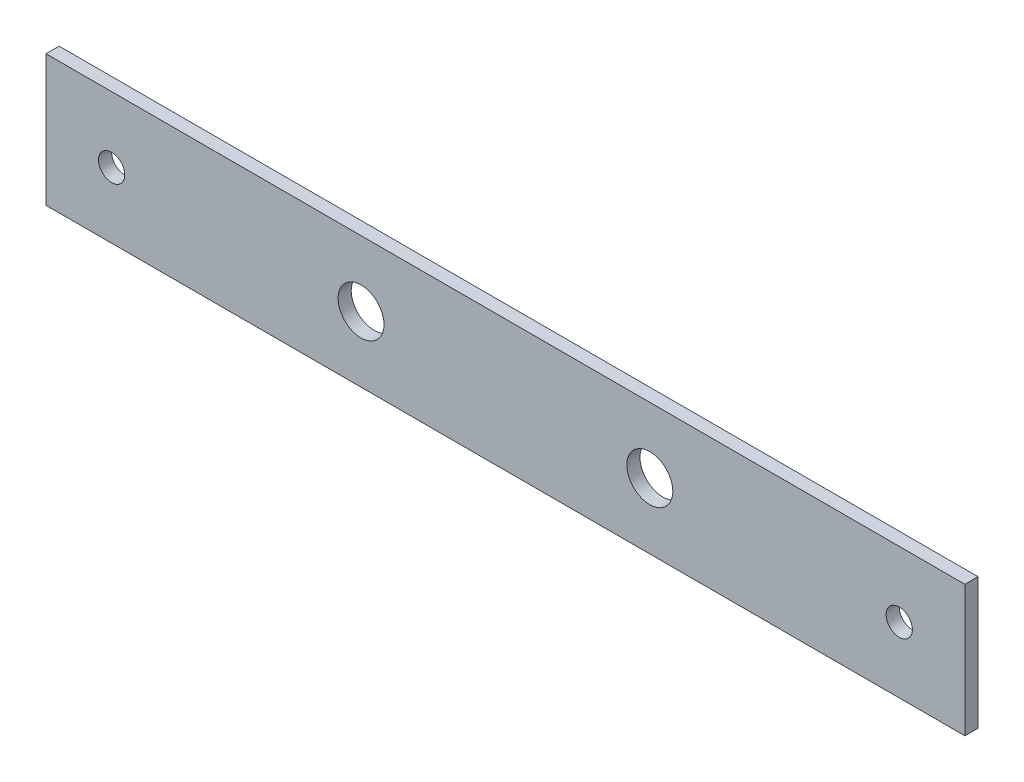
ISO-10303-21;
HEADER;
FILE_DESCRIPTION(('STEP AP214'),'2;1');
FILE_NAME('part.step','',(''),(''),'','','');
FILE_SCHEMA(('AUTOMOTIVE_DESIGN { 1 0 10303 214 1 1 1 1 }'));
ENDSEC;
DATA;
#1=APPLICATION_CONTEXT('core data for automotive mechanical design processes');
#2=APPLICATION_PROTOCOL_DEFINITION('international standard','automotive_design',2000,#1);
#3=PRODUCT_CONTEXT('',#1,'mechanical');
#4=PRODUCT('Part','Part','',(#3));
#5=PRODUCT_RELATED_PRODUCT_CATEGORY('part','',(#4));
#6=PRODUCT_DEFINITION_FORMATION('','',#4);
#7=PRODUCT_DEFINITION_CONTEXT('part definition',#1,'design');
#8=PRODUCT_DEFINITION('design','',#6,#7);
#9=PRODUCT_DEFINITION_SHAPE('','',#8);
#10=(LENGTH_UNIT() NAMED_UNIT(*) SI_UNIT(.MILLI.,.METRE.));
#11=(NAMED_UNIT(*) PLANE_ANGLE_UNIT() SI_UNIT($,.RADIAN.));
#12=(NAMED_UNIT(*) SI_UNIT($,.STERADIAN.) SOLID_ANGLE_UNIT());
#13=UNCERTAINTY_MEASURE_WITH_UNIT(LENGTH_MEASURE(1.E-05),#10,'distance_accuracy_value','');
#14=(GEOMETRIC_REPRESENTATION_CONTEXT(3) GLOBAL_UNCERTAINTY_ASSIGNED_CONTEXT((#13)) GLOBAL_UNIT_ASSIGNED_CONTEXT((#10,
#11,#12)) REPRESENTATION_CONTEXT('',''));
#15=CARTESIAN_POINT('',(0.,0.,0.));
#16=DIRECTION('',(0.,0.,1.));
#17=DIRECTION('',(1.,0.,0.));
#18=AXIS2_PLACEMENT_3D('',#15,#16,#17);
#19=CARTESIAN_POINT('',(70.,-10.,2.));
#20=DIRECTION('',(-1.,0.,0.));
#21=DIRECTION('',(0.,0.,1.));
#22=AXIS2_PLACEMENT_3D('',#19,#20,#21);
#23=PLANE('',#22);
#24=DIRECTION('',(0.,1.,0.));
#25=VECTOR('',#24,1.);
#26=CARTESIAN_POINT('',(70.,-10.,0.));
#27=LINE('',#26,#25);
#28=CARTESIAN_POINT('',(70.,-10.,0.));
#29=VERTEX_POINT('',#28);
#30=CARTESIAN_POINT('',(70.,10.,0.));
#31=VERTEX_POINT('',#30);
#32=EDGE_CURVE('E97',#29,#31,#27,.T.);
#33=ORIENTED_EDGE('',*,*,#32,.T.);
#34=DIRECTION('',(0.,0.,-1.));
#35=VECTOR('',#34,1.);
#36=CARTESIAN_POINT('',(70.,10.,2.));
#37=LINE('',#36,#35);
#38=CARTESIAN_POINT('',(70.,10.,2.));
#39=VERTEX_POINT('',#38);
#40=EDGE_CURVE('E11',#39,#31,#37,.T.);
#41=ORIENTED_EDGE('',*,*,#40,.F.);
#42=DIRECTION('',(0.,1.,0.));
#43=VECTOR('',#42,1.);
#44=CARTESIAN_POINT('',(70.,-10.,2.));
#45=LINE('',#44,#43);
#46=CARTESIAN_POINT('',(70.,-10.,2.));
#47=VERTEX_POINT('',#46);
#48=EDGE_CURVE('E85',#47,#39,#45,.T.);
#49=ORIENTED_EDGE('',*,*,#48,.F.);
#50=DIRECTION('',(0.,0.,-1.));
#51=VECTOR('',#50,1.);
#52=CARTESIAN_POINT('',(70.,-10.,2.));
#53=LINE('',#52,#51);
#54=EDGE_CURVE('E93',#47,#29,#53,.T.);
#55=ORIENTED_EDGE('',*,*,#54,.T.);
#56=EDGE_LOOP('',(#33,#41,#49,#55));
#57=FACE_BOUND('',#56,.T.);
#58=ADVANCED_FACE('F34',(#57),#23,.F.);
#59=CARTESIAN_POINT('',(-70.,10.,2.));
#60=DIRECTION('',(0.,-1.,0.));
#61=DIRECTION('',(0.,0.,-1.));
#62=AXIS2_PLACEMENT_3D('',#59,#60,#61);
#63=PLANE('',#62);
#64=DIRECTION('',(-1.,0.,0.));
#65=VECTOR('',#64,1.);
#66=CARTESIAN_POINT('',(-70.,10.,0.));
#67=LINE('',#66,#65);
#68=CARTESIAN_POINT('',(-70.,10.,0.));
#69=VERTEX_POINT('',#68);
#70=EDGE_CURVE('E89',#31,#69,#67,.T.);
#71=ORIENTED_EDGE('',*,*,#70,.T.);
#72=DIRECTION('',(0.,0.,-1.));
#73=VECTOR('',#72,1.);
#74=CARTESIAN_POINT('',(-70.,10.,2.));
#75=LINE('',#74,#73);
#76=CARTESIAN_POINT('',(-70.,10.,2.));
#77=VERTEX_POINT('',#76);
#78=EDGE_CURVE('E42',#77,#69,#75,.T.);
#79=ORIENTED_EDGE('',*,*,#78,.F.);
#80=DIRECTION('',(-1.,0.,0.));
#81=VECTOR('',#80,1.);
#82=CARTESIAN_POINT('',(-70.,10.,2.));
#83=LINE('',#82,#81);
#84=EDGE_CURVE('E80',#39,#77,#83,.T.);
#85=ORIENTED_EDGE('',*,*,#84,.F.);
#86=ORIENTED_EDGE('',*,*,#40,.T.);
#87=EDGE_LOOP('',(#71,#79,#85,#86));
#88=FACE_BOUND('',#87,.T.);
#89=ADVANCED_FACE('F88',(#88),#63,.F.);
#90=CARTESIAN_POINT('',(-70.,-10.,2.));
#91=DIRECTION('',(1.,0.,0.));
#92=DIRECTION('',(0.,0.,-1.));
#93=AXIS2_PLACEMENT_3D('',#90,#91,#92);
#94=PLANE('',#93);
#95=DIRECTION('',(0.,-1.,0.));
#96=VECTOR('',#95,1.);
#97=CARTESIAN_POINT('',(-70.,-10.,0.));
#98=LINE('',#97,#96);
#99=CARTESIAN_POINT('',(-70.,-10.,0.));
#100=VERTEX_POINT('',#99);
#101=EDGE_CURVE('E67',#69,#100,#98,.T.);
#102=ORIENTED_EDGE('',*,*,#101,.T.);
#103=DIRECTION('',(0.,0.,-1.));
#104=VECTOR('',#103,1.);
#105=CARTESIAN_POINT('',(-70.,-10.,2.));
#106=LINE('',#105,#104);
#107=CARTESIAN_POINT('',(-70.,-10.,2.));
#108=VERTEX_POINT('',#107);
#109=EDGE_CURVE('E90',#108,#100,#106,.T.);
#110=ORIENTED_EDGE('',*,*,#109,.F.);
#111=DIRECTION('',(0.,-1.,0.));
#112=VECTOR('',#111,1.);
#113=CARTESIAN_POINT('',(-70.,-10.,2.));
#114=LINE('',#113,#112);
#115=EDGE_CURVE('E83',#77,#108,#114,.T.);
#116=ORIENTED_EDGE('',*,*,#115,.F.);
#117=ORIENTED_EDGE('',*,*,#78,.T.);
#118=EDGE_LOOP('',(#102,#110,#116,#117));
#119=FACE_BOUND('',#118,.T.);
#120=ADVANCED_FACE('F91',(#119),#94,.F.);
#121=CARTESIAN_POINT('',(-70.,-10.,2.));
#122=DIRECTION('',(0.,1.,0.));
#123=DIRECTION('',(0.,0.,1.));
#124=AXIS2_PLACEMENT_3D('',#121,#122,#123);
#125=PLANE('',#124);
#126=DIRECTION('',(1.,0.,0.));
#127=VECTOR('',#126,1.);
#128=CARTESIAN_POINT('',(-70.,-10.,0.));
#129=LINE('',#128,#127);
#130=EDGE_CURVE('E73',#100,#29,#129,.T.);
#131=ORIENTED_EDGE('',*,*,#130,.T.);
#132=ORIENTED_EDGE('',*,*,#54,.F.);
#133=DIRECTION('',(1.,0.,0.));
#134=VECTOR('',#133,1.);
#135=CARTESIAN_POINT('',(-70.,-10.,2.));
#136=LINE('',#135,#134);
#137=EDGE_CURVE('E50',#108,#47,#136,.T.);
#138=ORIENTED_EDGE('',*,*,#137,.F.);
#139=ORIENTED_EDGE('',*,*,#109,.T.);
#140=EDGE_LOOP('',(#131,#132,#138,#139));
#141=FACE_BOUND('',#140,.T.);
#142=ADVANCED_FACE('F105',(#141),#125,.F.);
#143=CARTESIAN_POINT('',(0.,0.,2.));
#144=DIRECTION('',(0.,0.,-1.));
#145=DIRECTION('',(-1.,0.,0.));
#146=AXIS2_PLACEMENT_3D('',#143,#144,#145);
#147=PLANE('',#146);
#148=CARTESIAN_POINT('',(22.,0.,2.));
#149=DIRECTION('',(0.,0.,1.));
#150=DIRECTION('',(1.,0.,0.));
#151=AXIS2_PLACEMENT_3D('',#148,#149,#150);
#152=CIRCLE('',#151,3.5);
#153=CARTESIAN_POINT('',(25.5,0.,2.));
#154=VERTEX_POINT('',#153);
#155=EDGE_CURVE('E115',#154,#154,#152,.T.);
#156=ORIENTED_EDGE('',*,*,#155,.F.);
#157=EDGE_LOOP('',(#156));
#158=FACE_BOUND('',#157,.T.);
#159=CARTESIAN_POINT('',(-22.,0.,2.));
#160=DIRECTION('',(0.,0.,1.));
#161=DIRECTION('',(1.,0.,0.));
#162=AXIS2_PLACEMENT_3D('',#159,#160,#161);
#163=CIRCLE('',#162,3.5);
#164=CARTESIAN_POINT('',(-18.5,0.,2.));
#165=VERTEX_POINT('',#164);
#166=EDGE_CURVE('E126',#165,#165,#163,.T.);
#167=ORIENTED_EDGE('',*,*,#166,.F.);
#168=EDGE_LOOP('',(#167));
#169=FACE_BOUND('',#168,.T.);
#170=CARTESIAN_POINT('',(-60.,0.,2.));
#171=DIRECTION('',(0.,0.,1.));
#172=DIRECTION('',(1.,0.,0.));
#173=AXIS2_PLACEMENT_3D('',#170,#171,#172);
#174=CIRCLE('',#173,2.);
#175=CARTESIAN_POINT('',(-58.,0.,2.));
#176=VERTEX_POINT('',#175);
#177=EDGE_CURVE('E118',#176,#176,#174,.T.);
#178=ORIENTED_EDGE('',*,*,#177,.F.);
#179=EDGE_LOOP('',(#178));
#180=FACE_BOUND('',#179,.T.);
#181=CARTESIAN_POINT('',(60.,0.,2.));
#182=DIRECTION('',(0.,0.,1.));
#183=DIRECTION('',(1.,0.,0.));
#184=AXIS2_PLACEMENT_3D('',#181,#182,#183);
#185=CIRCLE('',#184,2.);
#186=CARTESIAN_POINT('',(62.,0.,2.));
#187=VERTEX_POINT('',#186);
#188=EDGE_CURVE('E111',#187,#187,#185,.T.);
#189=ORIENTED_EDGE('',*,*,#188,.F.);
#190=EDGE_LOOP('',(#189));
#191=FACE_BOUND('',#190,.T.);
#192=ORIENTED_EDGE('',*,*,#48,.T.);
#193=ORIENTED_EDGE('',*,*,#84,.T.);
#194=ORIENTED_EDGE('',*,*,#115,.T.);
#195=ORIENTED_EDGE('',*,*,#137,.T.);
#196=EDGE_LOOP('',(#192,#193,#194,#195));
#197=FACE_BOUND('',#196,.T.);
#198=ADVANCED_FACE('F81',(#158,#169,#180,#191,#197),#147,.F.);
#199=CARTESIAN_POINT('',(0.,0.,0.));
#200=DIRECTION('',(0.,0.,-1.));
#201=DIRECTION('',(-1.,0.,0.));
#202=AXIS2_PLACEMENT_3D('',#199,#200,#201);
#203=PLANE('',#202);
#204=CARTESIAN_POINT('',(22.,0.,0.));
#205=DIRECTION('',(0.,0.,-1.));
#206=DIRECTION('',(-1.,0.,0.));
#207=AXIS2_PLACEMENT_3D('',#204,#205,#206);
#208=CIRCLE('',#207,3.5);
#209=CARTESIAN_POINT('',(18.5,0.,0.));
#210=VERTEX_POINT('',#209);
#211=EDGE_CURVE('E129',#210,#210,#208,.F.);
#212=ORIENTED_EDGE('',*,*,#211,.T.);
#213=EDGE_LOOP('',(#212));
#214=FACE_BOUND('',#213,.T.);
#215=CARTESIAN_POINT('',(-22.,0.,0.));
#216=DIRECTION('',(0.,0.,-1.));
#217=DIRECTION('',(-1.,0.,0.));
#218=AXIS2_PLACEMENT_3D('',#215,#216,#217);
#219=CIRCLE('',#218,3.5);
#220=CARTESIAN_POINT('',(-25.5,0.,0.));
#221=VERTEX_POINT('',#220);
#222=EDGE_CURVE('E123',#221,#221,#219,.F.);
#223=ORIENTED_EDGE('',*,*,#222,.T.);
#224=EDGE_LOOP('',(#223));
#225=FACE_BOUND('',#224,.T.);
#226=CARTESIAN_POINT('',(-60.,0.,0.));
#227=DIRECTION('',(0.,0.,1.));
#228=DIRECTION('',(1.,0.,0.));
#229=AXIS2_PLACEMENT_3D('',#226,#227,#228);
#230=CIRCLE('',#229,2.);
#231=CARTESIAN_POINT('',(-58.,0.,0.));
#232=VERTEX_POINT('',#231);
#233=EDGE_CURVE('E100',#232,#232,#230,.T.);
#234=ORIENTED_EDGE('',*,*,#233,.T.);
#235=EDGE_LOOP('',(#234));
#236=FACE_BOUND('',#235,.T.);
#237=CARTESIAN_POINT('',(60.,0.,0.));
#238=DIRECTION('',(0.,0.,1.));
#239=DIRECTION('',(1.,0.,0.));
#240=AXIS2_PLACEMENT_3D('',#237,#238,#239);
#241=CIRCLE('',#240,2.);
#242=CARTESIAN_POINT('',(62.,0.,0.));
#243=VERTEX_POINT('',#242);
#244=EDGE_CURVE('E114',#243,#243,#241,.T.);
#245=ORIENTED_EDGE('',*,*,#244,.T.);
#246=EDGE_LOOP('',(#245));
#247=FACE_BOUND('',#246,.T.);
#248=ORIENTED_EDGE('',*,*,#32,.F.);
#249=ORIENTED_EDGE('',*,*,#130,.F.);
#250=ORIENTED_EDGE('',*,*,#101,.F.);
#251=ORIENTED_EDGE('',*,*,#70,.F.);
#252=EDGE_LOOP('',(#248,#249,#250,#251));
#253=FACE_BOUND('',#252,.T.);
#254=ADVANCED_FACE('F108',(#214,#225,#236,#247,#253),#203,.T.);
#255=CARTESIAN_POINT('',(60.,0.,0.));
#256=DIRECTION('',(0.,0.,1.));
#257=DIRECTION('',(1.,0.,0.));
#258=AXIS2_PLACEMENT_3D('',#255,#256,#257);
#259=CYLINDRICAL_SURFACE('',#258,2.);
#260=ORIENTED_EDGE('',*,*,#244,.F.);
#261=EDGE_LOOP('',(#260));
#262=FACE_BOUND('',#261,.T.);
#263=ORIENTED_EDGE('',*,*,#188,.T.);
#264=EDGE_LOOP('',(#263));
#265=FACE_BOUND('',#264,.T.);
#266=ADVANCED_FACE('F146',(#262,#265),#259,.F.);
#267=CARTESIAN_POINT('',(-60.,0.,0.));
#268=DIRECTION('',(0.,0.,1.));
#269=DIRECTION('',(1.,0.,0.));
#270=AXIS2_PLACEMENT_3D('',#267,#268,#269);
#271=CYLINDRICAL_SURFACE('',#270,2.);
#272=ORIENTED_EDGE('',*,*,#233,.F.);
#273=EDGE_LOOP('',(#272));
#274=FACE_BOUND('',#273,.T.);
#275=ORIENTED_EDGE('',*,*,#177,.T.);
#276=EDGE_LOOP('',(#275));
#277=FACE_BOUND('',#276,.T.);
#278=ADVANCED_FACE('F148',(#274,#277),#271,.F.);
#279=CARTESIAN_POINT('',(-22.,0.,-0.00100000000000013));
#280=DIRECTION('',(0.,0.,1.));
#281=DIRECTION('',(1.,0.,0.));
#282=AXIS2_PLACEMENT_3D('',#279,#280,#281);
#283=CYLINDRICAL_SURFACE('',#282,3.5);
#284=ORIENTED_EDGE('',*,*,#222,.F.);
#285=EDGE_LOOP('',(#284));
#286=FACE_BOUND('',#285,.T.);
#287=ORIENTED_EDGE('',*,*,#166,.T.);
#288=EDGE_LOOP('',(#287));
#289=FACE_BOUND('',#288,.T.);
#290=ADVANCED_FACE('F155',(#286,#289),#283,.F.);
#291=CARTESIAN_POINT('',(22.,0.,-0.00100000000000013));
#292=DIRECTION('',(0.,0.,1.));
#293=DIRECTION('',(1.,0.,0.));
#294=AXIS2_PLACEMENT_3D('',#291,#292,#293);
#295=CYLINDRICAL_SURFACE('',#294,3.5);
#296=ORIENTED_EDGE('',*,*,#211,.F.);
#297=EDGE_LOOP('',(#296));
#298=FACE_BOUND('',#297,.T.);
#299=ORIENTED_EDGE('',*,*,#155,.T.);
#300=EDGE_LOOP('',(#299));
#301=FACE_BOUND('',#300,.T.);
#302=ADVANCED_FACE('F135',(#298,#301),#295,.F.);
#303=CLOSED_SHELL('',(#58,#89,#120,#142,#198,#254,#266,#278,#290,#302));
#304=MANIFOLD_SOLID_BREP('B2',#303);
#305=ADVANCED_BREP_SHAPE_REPRESENTATION('',(#18,#304),#14);
#306=SHAPE_DEFINITION_REPRESENTATION(#9,#305);
ENDSEC;
END-ISO-10303-21;
